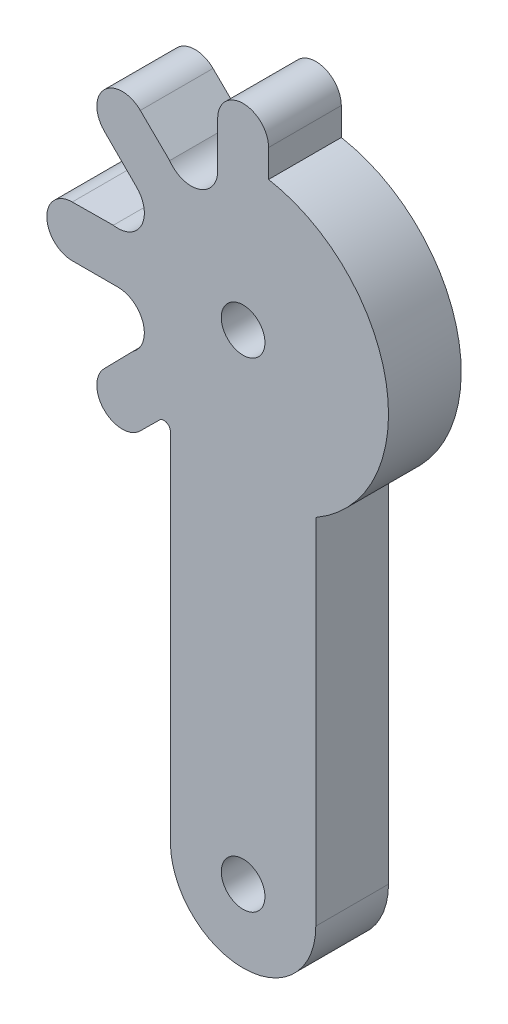
ISO-10303-21;
HEADER;
FILE_DESCRIPTION(('STEP AP214'),'2;1');
FILE_NAME('part.step','',(''),(''),'','','');
FILE_SCHEMA(('AUTOMOTIVE_DESIGN { 1 0 10303 214 1 1 1 1 }'));
ENDSEC;
DATA;
#1=APPLICATION_CONTEXT('core data for automotive mechanical design processes');
#2=APPLICATION_PROTOCOL_DEFINITION('international standard','automotive_design',2000,#1);
#3=PRODUCT_CONTEXT('',#1,'mechanical');
#4=PRODUCT('Part','Part','',(#3));
#5=PRODUCT_RELATED_PRODUCT_CATEGORY('part','',(#4));
#6=PRODUCT_DEFINITION_FORMATION('','',#4);
#7=PRODUCT_DEFINITION_CONTEXT('part definition',#1,'design');
#8=PRODUCT_DEFINITION('design','',#6,#7);
#9=PRODUCT_DEFINITION_SHAPE('','',#8);
#10=(LENGTH_UNIT() NAMED_UNIT(*) SI_UNIT(.MILLI.,.METRE.));
#11=(NAMED_UNIT(*) PLANE_ANGLE_UNIT() SI_UNIT($,.RADIAN.));
#12=(NAMED_UNIT(*) SI_UNIT($,.STERADIAN.) SOLID_ANGLE_UNIT());
#13=UNCERTAINTY_MEASURE_WITH_UNIT(LENGTH_MEASURE(1.E-05),#10,'distance_accuracy_value','');
#14=(GEOMETRIC_REPRESENTATION_CONTEXT(3) GLOBAL_UNCERTAINTY_ASSIGNED_CONTEXT((#13)) GLOBAL_UNIT_ASSIGNED_CONTEXT((#10,
#11,#12)) REPRESENTATION_CONTEXT('',''));
#15=CARTESIAN_POINT('',(0.,0.,0.));
#16=DIRECTION('',(0.,0.,1.));
#17=DIRECTION('',(1.,0.,0.));
#18=AXIS2_PLACEMENT_3D('',#15,#16,#17);
#19=CARTESIAN_POINT('',(-8.60435496311575,3.56722960093964,5.));
#20=DIRECTION('',(0.,0.,-1.));
#21=DIRECTION('',(-1.,0.,0.));
#22=AXIS2_PLACEMENT_3D('',#19,#20,#21);
#23=CYLINDRICAL_SURFACE('',#22,1.81450757459091);
#24=CARTESIAN_POINT('',(-8.60435496311575,3.56722960093964,0.));
#25=DIRECTION('',(0.,0.,1.));
#26=DIRECTION('',(1.,0.,0.));
#27=AXIS2_PLACEMENT_3D('',#24,#25,#26);
#28=CIRCLE('',#27,1.81450757459091);
#29=CARTESIAN_POINT('',(-8.9244970866409,1.78118739567333,0.));
#30=VERTEX_POINT('',#29);
#31=CARTESIAN_POINT('',(-7.32130435260817,4.85028021144723,0.));
#32=VERTEX_POINT('',#31);
#33=EDGE_CURVE('E224',#30,#32,#28,.T.);
#34=ORIENTED_EDGE('',*,*,#33,.F.);
#35=DIRECTION('',(0.,0.,-1.));
#36=VECTOR('',#35,1.);
#37=CARTESIAN_POINT('',(-8.9244970866409,1.78118739567333,5.));
#38=LINE('',#37,#36);
#39=CARTESIAN_POINT('',(-8.9244970866409,1.78118739567333,5.));
#40=VERTEX_POINT('',#39);
#41=EDGE_CURVE('E11',#40,#30,#38,.T.);
#42=ORIENTED_EDGE('',*,*,#41,.F.);
#43=CARTESIAN_POINT('',(-8.60435496311575,3.56722960093964,5.));
#44=DIRECTION('',(0.,0.,1.));
#45=DIRECTION('',(1.,0.,0.));
#46=AXIS2_PLACEMENT_3D('',#43,#44,#45);
#47=CIRCLE('',#46,1.81450757459091);
#48=CARTESIAN_POINT('',(-7.32130435260817,4.85028021144723,5.));
#49=VERTEX_POINT('',#48);
#50=EDGE_CURVE('E301',#40,#49,#47,.T.);
#51=ORIENTED_EDGE('',*,*,#50,.T.);
#52=DIRECTION('',(0.,0.,-1.));
#53=VECTOR('',#52,1.);
#54=CARTESIAN_POINT('',(-7.32130435260817,4.85028021144723,5.));
#55=LINE('',#54,#53);
#56=EDGE_CURVE('E129',#49,#32,#55,.T.);
#57=ORIENTED_EDGE('',*,*,#56,.T.);
#58=EDGE_LOOP('',(#34,#42,#51,#57));
#59=FACE_BOUND('',#58,.T.);
#60=ADVANCED_FACE('F42',(#59),#23,.F.);
#61=CARTESIAN_POINT('',(-0.0188511817434176,1.8709197069388,5.));
#62=DIRECTION('',(-0.0100753788774422,0.999949242082055,0.));
#63=DIRECTION('',(-0.999949242082055,-0.0100753788774422,0.));
#64=AXIS2_PLACEMENT_3D('',#61,#62,#63);
#65=PLANE('',#64);
#66=DIRECTION('',(0.999949242082055,0.0100753788774422,0.));
#67=VECTOR('',#66,1.);
#68=CARTESIAN_POINT('',(-0.0188511817434176,1.8709197069388,0.));
#69=LINE('',#68,#67);
#70=CARTESIAN_POINT('',(-11.7495942695045,1.7527220263475,0.));
#71=VERTEX_POINT('',#70);
#72=EDGE_CURVE('E228',#71,#30,#69,.T.);
#73=ORIENTED_EDGE('',*,*,#72,.F.);
#74=DIRECTION('',(0.,0.,-1.));
#75=VECTOR('',#74,1.);
#76=CARTESIAN_POINT('',(-11.7495942695045,1.7527220263475,5.));
#77=LINE('',#76,#75);
#78=CARTESIAN_POINT('',(-11.7495942695045,1.7527220263475,5.));
#79=VERTEX_POINT('',#78);
#80=EDGE_CURVE('E51',#79,#71,#77,.T.);
#81=ORIENTED_EDGE('',*,*,#80,.F.);
#82=DIRECTION('',(0.999949242082055,0.0100753788774422,0.));
#83=VECTOR('',#82,1.);
#84=CARTESIAN_POINT('',(-0.0188511817434176,1.8709197069388,5.));
#85=LINE('',#84,#83);
#86=EDGE_CURVE('E370',#79,#40,#85,.T.);
#87=ORIENTED_EDGE('',*,*,#86,.T.);
#88=ORIENTED_EDGE('',*,*,#41,.T.);
#89=EDGE_LOOP('',(#73,#81,#87,#88));
#90=FACE_BOUND('',#89,.T.);
#91=ADVANCED_FACE('F369',(#90),#65,.T.);
#92=CARTESIAN_POINT('',(-11.7497969770993,0.0027220498281179,5.));
#93=DIRECTION('',(0.,0.,-1.));
#94=DIRECTION('',(-1.,0.,0.));
#95=AXIS2_PLACEMENT_3D('',#92,#93,#94);
#96=CYLINDRICAL_SURFACE('',#95,1.74999998825949);
#97=CARTESIAN_POINT('',(-11.7497969770993,0.0027220498281179,0.));
#98=DIRECTION('',(0.,0.,1.));
#99=DIRECTION('',(1.,0.,0.));
#100=AXIS2_PLACEMENT_3D('',#97,#98,#99);
#101=CIRCLE('',#100,1.74999998825949);
#102=CARTESIAN_POINT('',(-11.7499996846942,-1.74727792669126,0.));
#103=VERTEX_POINT('',#102);
#104=EDGE_CURVE('E232',#71,#103,#101,.T.);
#105=ORIENTED_EDGE('',*,*,#104,.T.);
#106=DIRECTION('',(0.,0.,-1.));
#107=VECTOR('',#106,1.);
#108=CARTESIAN_POINT('',(-11.7499996846942,-1.74727792669126,5.));
#109=LINE('',#108,#107);
#110=CARTESIAN_POINT('',(-11.7499996846942,-1.74727792669126,5.));
#111=VERTEX_POINT('',#110);
#112=EDGE_CURVE('E350',#111,#103,#109,.T.);
#113=ORIENTED_EDGE('',*,*,#112,.F.);
#114=CARTESIAN_POINT('',(-11.7497969770993,0.0027220498281179,5.));
#115=DIRECTION('',(0.,0.,1.));
#116=DIRECTION('',(1.,0.,0.));
#117=AXIS2_PLACEMENT_3D('',#114,#115,#116);
#118=CIRCLE('',#117,1.74999998825949);
#119=EDGE_CURVE('E360',#79,#111,#118,.T.);
#120=ORIENTED_EDGE('',*,*,#119,.F.);
#121=ORIENTED_EDGE('',*,*,#80,.T.);
#122=EDGE_LOOP('',(#105,#113,#120,#121));
#123=FACE_BOUND('',#122,.T.);
#124=ADVANCED_FACE('F358',(#123),#96,.T.);
#125=CARTESIAN_POINT('',(0.,-1.74727792669126,5.));
#126=DIRECTION('',(0.,1.,0.));
#127=DIRECTION('',(0.,0.,1.));
#128=AXIS2_PLACEMENT_3D('',#125,#126,#127);
#129=PLANE('',#128);
#130=DIRECTION('',(1.,0.,0.));
#131=VECTOR('',#130,1.);
#132=CARTESIAN_POINT('',(0.,-1.74727792669126,0.));
#133=LINE('',#132,#131);
#134=CARTESIAN_POINT('',(-8.60660998302956,-1.74727792669126,0.));
#135=VERTEX_POINT('',#134);
#136=EDGE_CURVE('E234',#103,#135,#133,.T.);
#137=ORIENTED_EDGE('',*,*,#136,.T.);
#138=DIRECTION('',(0.,0.,-1.));
#139=VECTOR('',#138,1.);
#140=CARTESIAN_POINT('',(-8.60660998302956,-1.74727792669126,5.));
#141=LINE('',#140,#139);
#142=CARTESIAN_POINT('',(-8.60660998302956,-1.74727792669126,5.));
#143=VERTEX_POINT('',#142);
#144=EDGE_CURVE('E347',#143,#135,#141,.T.);
#145=ORIENTED_EDGE('',*,*,#144,.F.);
#146=DIRECTION('',(1.,0.,0.));
#147=VECTOR('',#146,1.);
#148=CARTESIAN_POINT('',(0.,-1.74727792669126,5.));
#149=LINE('',#148,#147);
#150=EDGE_CURVE('E381',#111,#143,#149,.T.);
#151=ORIENTED_EDGE('',*,*,#150,.F.);
#152=ORIENTED_EDGE('',*,*,#112,.T.);
#153=EDGE_LOOP('',(#137,#145,#151,#152));
#154=FACE_BOUND('',#153,.T.);
#155=ADVANCED_FACE('F479',(#154),#129,.F.);
#156=CARTESIAN_POINT('',(-8.60660998302956,-3.56178550128217,5.));
#157=DIRECTION('',(0.,0.,-1.));
#158=DIRECTION('',(-1.,0.,0.));
#159=AXIS2_PLACEMENT_3D('',#156,#157,#158);
#160=CYLINDRICAL_SURFACE('',#159,1.81450757459091);
#161=CARTESIAN_POINT('',(-8.60660998302956,-3.56178550128217,0.));
#162=DIRECTION('',(0.,0.,1.));
#163=DIRECTION('',(1.,0.,0.));
#164=AXIS2_PLACEMENT_3D('',#161,#162,#163);
#165=CIRCLE('',#164,1.81450757459091);
#166=CARTESIAN_POINT('',(-7.57006209468847,-5.05108272259946,0.));
#167=VERTEX_POINT('',#166);
#168=EDGE_CURVE('E238',#167,#135,#165,.T.);
#169=ORIENTED_EDGE('',*,*,#168,.F.);
#170=DIRECTION('',(0.,0.,-1.));
#171=VECTOR('',#170,1.);
#172=CARTESIAN_POINT('',(-7.57006209468847,-5.05108272259946,5.));
#173=LINE('',#172,#171);
#174=CARTESIAN_POINT('',(-7.57006209468847,-5.05108272259946,5.));
#175=VERTEX_POINT('',#174);
#176=EDGE_CURVE('E344',#175,#167,#173,.T.);
#177=ORIENTED_EDGE('',*,*,#176,.F.);
#178=CARTESIAN_POINT('',(-8.60660998302956,-3.56178550128217,5.));
#179=DIRECTION('',(0.,0.,1.));
#180=DIRECTION('',(1.,0.,0.));
#181=AXIS2_PLACEMENT_3D('',#178,#179,#180);
#182=CIRCLE('',#181,1.81450757459091);
#183=EDGE_CURVE('E384',#175,#143,#182,.T.);
#184=ORIENTED_EDGE('',*,*,#183,.T.);
#185=ORIENTED_EDGE('',*,*,#144,.T.);
#186=EDGE_LOOP('',(#169,#177,#184,#185));
#187=FACE_BOUND('',#186,.T.);
#188=ADVANCED_FACE('F475',(#187),#160,.F.);
#189=CARTESIAN_POINT('',(-1.33626981027573,1.30961021338754,5.));
#190=DIRECTION('',(-0.714195258645806,0.699946521191333,0.));
#191=DIRECTION('',(-0.699946521191333,-0.714195258645806,0.));
#192=AXIS2_PLACEMENT_3D('',#189,#190,#191);
#193=PLANE('',#192);
#194=DIRECTION('',(0.699946521191333,0.714195258645806,0.));
#195=VECTOR('',#194,1.);
#196=CARTESIAN_POINT('',(-1.33626981027573,1.30961021338754,0.));
#197=LINE('',#196,#195);
#198=CARTESIAN_POINT('',(-9.54757941452242,-7.06885615379178,0.));
#199=VERTEX_POINT('',#198);
#200=EDGE_CURVE('E242',#199,#167,#197,.T.);
#201=ORIENTED_EDGE('',*,*,#200,.F.);
#202=DIRECTION('',(0.,0.,-1.));
#203=VECTOR('',#202,1.);
#204=CARTESIAN_POINT('',(-9.54757941452242,-7.06885615379178,5.));
#205=LINE('',#204,#203);
#206=CARTESIAN_POINT('',(-9.54757941452242,-7.06885615379178,5.));
#207=VERTEX_POINT('',#206);
#208=EDGE_CURVE('E341',#207,#199,#205,.T.);
#209=ORIENTED_EDGE('',*,*,#208,.F.);
#210=DIRECTION('',(0.699946521191333,0.714195258645806,0.));
#211=VECTOR('',#210,1.);
#212=CARTESIAN_POINT('',(-1.33626981027573,1.30961021338754,5.));
#213=LINE('',#212,#211);
#214=EDGE_CURVE('E388',#207,#175,#213,.T.);
#215=ORIENTED_EDGE('',*,*,#214,.T.);
#216=ORIENTED_EDGE('',*,*,#176,.T.);
#217=EDGE_LOOP('',(#201,#209,#215,#216));
#218=FACE_BOUND('',#217,.T.);
#219=ADVANCED_FACE('F469',(#218),#193,.T.);
#220=CARTESIAN_POINT('',(-8.3104292524822,-8.30657965949242,5.));
#221=DIRECTION('',(0.,0.,-1.));
#222=DIRECTION('',(-1.,0.,0.));
#223=AXIS2_PLACEMENT_3D('',#220,#221,#222);
#224=CYLINDRICAL_SURFACE('',#223,1.75);
#225=CARTESIAN_POINT('',(-8.3104292524822,-8.30657965949242,0.));
#226=DIRECTION('',(0.,0.,1.));
#227=DIRECTION('',(1.,0.,0.));
#228=AXIS2_PLACEMENT_3D('',#225,#226,#227);
#229=CIRCLE('',#228,1.75);
#230=CARTESIAN_POINT('',(-7.07299238540574,-9.54401652656888,0.));
#231=VERTEX_POINT('',#230);
#232=EDGE_CURVE('E246',#199,#231,#229,.T.);
#233=ORIENTED_EDGE('',*,*,#232,.T.);
#234=DIRECTION('',(0.,0.,-1.));
#235=VECTOR('',#234,1.);
#236=CARTESIAN_POINT('',(-7.07299238540574,-9.54401652656888,5.));
#237=LINE('',#236,#235);
#238=CARTESIAN_POINT('',(-7.07299238540574,-9.54401652656888,5.));
#239=VERTEX_POINT('',#238);
#240=EDGE_CURVE('E337',#239,#231,#237,.T.);
#241=ORIENTED_EDGE('',*,*,#240,.F.);
#242=CARTESIAN_POINT('',(-8.3104292524822,-8.30657965949242,5.));
#243=DIRECTION('',(0.,0.,1.));
#244=DIRECTION('',(1.,0.,0.));
#245=AXIS2_PLACEMENT_3D('',#242,#243,#244);
#246=CIRCLE('',#245,1.75);
#247=EDGE_CURVE('E392',#207,#239,#246,.T.);
#248=ORIENTED_EDGE('',*,*,#247,.F.);
#249=ORIENTED_EDGE('',*,*,#208,.T.);
#250=EDGE_LOOP('',(#233,#241,#248,#249));
#251=FACE_BOUND('',#250,.T.);
#252=ADVANCED_FACE('F480',(#251),#224,.T.);
#253=CARTESIAN_POINT('',(1.25999875279265,-1.26879482078728,5.));
#254=DIRECTION('',(-0.704642942712236,0.70956206443541,0.));
#255=DIRECTION('',(-0.70956206443541,-0.704642942712236,0.));
#256=AXIS2_PLACEMENT_3D('',#253,#254,#255);
#257=PLANE('',#256);
#258=DIRECTION('',(0.70956206443541,0.704642942712236,0.));
#259=VECTOR('',#258,1.);
#260=CARTESIAN_POINT('',(1.25999875279265,-1.26879482078728,0.));
#261=LINE('',#260,#259);
#262=CARTESIAN_POINT('',(-5.75027059710416,-8.23046466125033,0.));
#263=VERTEX_POINT('',#262);
#264=EDGE_CURVE('E249',#231,#263,#261,.T.);
#265=ORIENTED_EDGE('',*,*,#264,.T.);
#266=DIRECTION('',(0.,0.,-1.));
#267=VECTOR('',#266,1.);
#268=CARTESIAN_POINT('',(-5.75027059710416,-8.23046466125033,5.));
#269=LINE('',#268,#267);
#270=CARTESIAN_POINT('',(-5.75027059710416,-8.23046466125033,5.));
#271=VERTEX_POINT('',#270);
#272=EDGE_CURVE('E334',#271,#263,#269,.T.);
#273=ORIENTED_EDGE('',*,*,#272,.F.);
#274=DIRECTION('',(0.70956206443541,0.704642942712236,0.));
#275=VECTOR('',#274,1.);
#276=CARTESIAN_POINT('',(1.25999875279265,-1.26879482078728,5.));
#277=LINE('',#276,#275);
#278=EDGE_CURVE('E395',#239,#271,#277,.T.);
#279=ORIENTED_EDGE('',*,*,#278,.F.);
#280=ORIENTED_EDGE('',*,*,#240,.T.);
#281=EDGE_LOOP('',(#265,#273,#279,#280));
#282=FACE_BOUND('',#281,.T.);
#283=ADVANCED_FACE('F463',(#282),#257,.F.);
#284=CARTESIAN_POINT('',(-5.44013357771594,-8.54276675128179,5.));
#285=DIRECTION('',(0.,0.,-1.));
#286=DIRECTION('',(-1.,0.,0.));
#287=AXIS2_PLACEMENT_3D('',#284,#285,#286);
#288=CYLINDRICAL_SURFACE('',#287,0.440133577715941);
#289=CARTESIAN_POINT('',(-5.44013357771594,-8.54276675128179,0.));
#290=DIRECTION('',(0.,0.,1.));
#291=DIRECTION('',(1.,0.,0.));
#292=AXIS2_PLACEMENT_3D('',#289,#290,#291);
#293=CIRCLE('',#292,0.440133577715941);
#294=CARTESIAN_POINT('',(-5.,-8.54276675128179,0.));
#295=VERTEX_POINT('',#294);
#296=EDGE_CURVE('E253',#295,#263,#293,.T.);
#297=ORIENTED_EDGE('',*,*,#296,.F.);
#298=DIRECTION('',(0.,0.,-1.));
#299=VECTOR('',#298,1.);
#300=CARTESIAN_POINT('',(-5.,-8.54276675128179,5.));
#301=LINE('',#300,#299);
#302=CARTESIAN_POINT('',(-5.,-8.54276675128179,5.));
#303=VERTEX_POINT('',#302);
#304=EDGE_CURVE('E331',#303,#295,#301,.T.);
#305=ORIENTED_EDGE('',*,*,#304,.F.);
#306=CARTESIAN_POINT('',(-5.44013357771594,-8.54276675128179,5.));
#307=DIRECTION('',(0.,0.,1.));
#308=DIRECTION('',(1.,0.,0.));
#309=AXIS2_PLACEMENT_3D('',#306,#307,#308);
#310=CIRCLE('',#309,0.440133577715941);
#311=EDGE_CURVE('E398',#303,#271,#310,.T.);
#312=ORIENTED_EDGE('',*,*,#311,.T.);
#313=ORIENTED_EDGE('',*,*,#272,.T.);
#314=EDGE_LOOP('',(#297,#305,#312,#313));
#315=FACE_BOUND('',#314,.T.);
#316=ADVANCED_FACE('F457',(#315),#288,.F.);
#317=CARTESIAN_POINT('',(-4.99999999999998,0.,5.));
#318=DIRECTION('',(1.,0.,0.));
#319=DIRECTION('',(0.,1.,0.));
#320=AXIS2_PLACEMENT_3D('',#317,#318,#319);
#321=PLANE('',#320);
#322=DIRECTION('',(0.,-1.,0.));
#323=VECTOR('',#322,1.);
#324=CARTESIAN_POINT('',(-4.99999999999998,0.,0.));
#325=LINE('',#324,#323);
#326=CARTESIAN_POINT('',(-5.00000000000005,-33.,0.));
#327=VERTEX_POINT('',#326);
#328=EDGE_CURVE('E257',#295,#327,#325,.T.);
#329=ORIENTED_EDGE('',*,*,#328,.T.);
#330=DIRECTION('',(0.,0.,-1.));
#331=VECTOR('',#330,1.);
#332=CARTESIAN_POINT('',(-5.00000000000005,-33.,5.));
#333=LINE('',#332,#331);
#334=CARTESIAN_POINT('',(-5.00000000000005,-33.,5.));
#335=VERTEX_POINT('',#334);
#336=EDGE_CURVE('E327',#335,#327,#333,.T.);
#337=ORIENTED_EDGE('',*,*,#336,.F.);
#338=DIRECTION('',(0.,-1.,0.));
#339=VECTOR('',#338,1.);
#340=CARTESIAN_POINT('',(-4.99999999999998,0.,5.));
#341=LINE('',#340,#339);
#342=EDGE_CURVE('E402',#303,#335,#341,.T.);
#343=ORIENTED_EDGE('',*,*,#342,.F.);
#344=ORIENTED_EDGE('',*,*,#304,.T.);
#345=EDGE_LOOP('',(#329,#337,#343,#344));
#346=FACE_BOUND('',#345,.T.);
#347=ADVANCED_FACE('F523',(#346),#321,.F.);
#348=CARTESIAN_POINT('',(0.,-33.,5.));
#349=DIRECTION('',(0.,0.,-1.));
#350=DIRECTION('',(-1.,0.,0.));
#351=AXIS2_PLACEMENT_3D('',#348,#349,#350);
#352=CYLINDRICAL_SURFACE('',#351,5.00000000000002);
#353=CARTESIAN_POINT('',(0.,-33.,0.));
#354=DIRECTION('',(0.,0.,1.));
#355=DIRECTION('',(1.,0.,0.));
#356=AXIS2_PLACEMENT_3D('',#353,#354,#355);
#357=CIRCLE('',#356,5.00000000000002);
#358=CARTESIAN_POINT('',(5.,-33.,0.));
#359=VERTEX_POINT('',#358);
#360=EDGE_CURVE('E260',#327,#359,#357,.T.);
#361=ORIENTED_EDGE('',*,*,#360,.T.);
#362=DIRECTION('',(0.,0.,-1.));
#363=VECTOR('',#362,1.);
#364=CARTESIAN_POINT('',(5.,-33.,5.));
#365=LINE('',#364,#363);
#366=CARTESIAN_POINT('',(5.,-33.,5.));
#367=VERTEX_POINT('',#366);
#368=EDGE_CURVE('E324',#367,#359,#365,.T.);
#369=ORIENTED_EDGE('',*,*,#368,.F.);
#370=CARTESIAN_POINT('',(0.,-33.,5.));
#371=DIRECTION('',(0.,0.,1.));
#372=DIRECTION('',(1.,0.,0.));
#373=AXIS2_PLACEMENT_3D('',#370,#371,#372);
#374=CIRCLE('',#373,5.00000000000002);
#375=EDGE_CURVE('E405',#335,#367,#374,.T.);
#376=ORIENTED_EDGE('',*,*,#375,.F.);
#377=ORIENTED_EDGE('',*,*,#336,.T.);
#378=EDGE_LOOP('',(#361,#369,#376,#377));
#379=FACE_BOUND('',#378,.T.);
#380=ADVANCED_FACE('F450',(#379),#352,.T.);
#381=CARTESIAN_POINT('',(5.,0.,5.));
#382=DIRECTION('',(1.,0.,0.));
#383=DIRECTION('',(0.,1.,0.));
#384=AXIS2_PLACEMENT_3D('',#381,#382,#383);
#385=PLANE('',#384);
#386=DIRECTION('',(0.,-1.,0.));
#387=VECTOR('',#386,1.);
#388=CARTESIAN_POINT('',(5.,0.,0.));
#389=LINE('',#388,#387);
#390=CARTESIAN_POINT('',(5.,-8.66025403784439,0.));
#391=VERTEX_POINT('',#390);
#392=EDGE_CURVE('E264',#391,#359,#389,.T.);
#393=ORIENTED_EDGE('',*,*,#392,.F.);
#394=DIRECTION('',(0.,0.,-1.));
#395=VECTOR('',#394,1.);
#396=CARTESIAN_POINT('',(5.,-8.66025403784439,5.));
#397=LINE('',#396,#395);
#398=CARTESIAN_POINT('',(5.,-8.66025403784439,5.));
#399=VERTEX_POINT('',#398);
#400=EDGE_CURVE('E321',#399,#391,#397,.T.);
#401=ORIENTED_EDGE('',*,*,#400,.F.);
#402=DIRECTION('',(0.,-1.,0.));
#403=VECTOR('',#402,1.);
#404=CARTESIAN_POINT('',(5.,0.,5.));
#405=LINE('',#404,#403);
#406=EDGE_CURVE('E407',#399,#367,#405,.T.);
#407=ORIENTED_EDGE('',*,*,#406,.T.);
#408=ORIENTED_EDGE('',*,*,#368,.T.);
#409=EDGE_LOOP('',(#393,#401,#407,#408));
#410=FACE_BOUND('',#409,.T.);
#411=ADVANCED_FACE('F445',(#410),#385,.T.);
#412=CARTESIAN_POINT('',(0.,0.,5.));
#413=DIRECTION('',(0.,0.,-1.));
#414=DIRECTION('',(-1.,0.,0.));
#415=AXIS2_PLACEMENT_3D('',#412,#413,#414);
#416=CYLINDRICAL_SURFACE('',#415,10.);
#417=CARTESIAN_POINT('',(0.,0.,0.));
#418=DIRECTION('',(0.,0.,1.));
#419=DIRECTION('',(1.,0.,0.));
#420=AXIS2_PLACEMENT_3D('',#417,#418,#419);
#421=CIRCLE('',#420,10.);
#422=CARTESIAN_POINT('',(1.75272202634986,9.84520012485008,0.));
#423=VERTEX_POINT('',#422);
#424=EDGE_CURVE('E268',#391,#423,#421,.T.);
#425=ORIENTED_EDGE('',*,*,#424,.T.);
#426=DIRECTION('',(0.,0.,-1.));
#427=VECTOR('',#426,1.);
#428=CARTESIAN_POINT('',(1.75272202634986,9.84520012485008,5.));
#429=LINE('',#428,#427);
#430=CARTESIAN_POINT('',(1.75272202634986,9.84520012485008,5.));
#431=VERTEX_POINT('',#430);
#432=EDGE_CURVE('E318',#431,#423,#429,.T.);
#433=ORIENTED_EDGE('',*,*,#432,.F.);
#434=CARTESIAN_POINT('',(0.,0.,5.));
#435=DIRECTION('',(0.,0.,1.));
#436=DIRECTION('',(1.,0.,0.));
#437=AXIS2_PLACEMENT_3D('',#434,#435,#436);
#438=CIRCLE('',#437,10.);
#439=EDGE_CURVE('E411',#399,#431,#438,.T.);
#440=ORIENTED_EDGE('',*,*,#439,.F.);
#441=ORIENTED_EDGE('',*,*,#400,.T.);
#442=EDGE_LOOP('',(#425,#433,#440,#441));
#443=FACE_BOUND('',#442,.T.);
#444=ADVANCED_FACE('F441',(#443),#416,.T.);
#445=CARTESIAN_POINT('',(1.75272202634986,0.,5.));
#446=DIRECTION('',(1.,0.,0.));
#447=DIRECTION('',(0.,0.,-1.));
#448=AXIS2_PLACEMENT_3D('',#445,#446,#447);
#449=PLANE('',#448);
#450=DIRECTION('',(0.,-1.,0.));
#451=VECTOR('',#450,1.);
#452=CARTESIAN_POINT('',(1.75272202634986,0.,0.));
#453=LINE('',#452,#451);
#454=CARTESIAN_POINT('',(1.75272202634986,11.7495942695041,0.));
#455=VERTEX_POINT('',#454);
#456=EDGE_CURVE('E272',#455,#423,#453,.T.);
#457=ORIENTED_EDGE('',*,*,#456,.F.);
#458=DIRECTION('',(0.,0.,-1.));
#459=VECTOR('',#458,1.);
#460=CARTESIAN_POINT('',(1.75272202634986,11.7495942695041,5.));
#461=LINE('',#460,#459);
#462=CARTESIAN_POINT('',(1.75272202634986,11.7495942695041,5.));
#463=VERTEX_POINT('',#462);
#464=EDGE_CURVE('E315',#463,#455,#461,.T.);
#465=ORIENTED_EDGE('',*,*,#464,.F.);
#466=DIRECTION('',(0.,-1.,0.));
#467=VECTOR('',#466,1.);
#468=CARTESIAN_POINT('',(1.75272202634986,0.,5.));
#469=LINE('',#468,#467);
#470=EDGE_CURVE('E414',#463,#431,#469,.T.);
#471=ORIENTED_EDGE('',*,*,#470,.T.);
#472=ORIENTED_EDGE('',*,*,#432,.T.);
#473=EDGE_LOOP('',(#457,#465,#471,#472));
#474=FACE_BOUND('',#473,.T.);
#475=ADVANCED_FACE('F437',(#474),#449,.T.);
#476=CARTESIAN_POINT('',(0.00272207331027802,11.7499996846943,5.));
#477=DIRECTION('',(0.,0.,-1.));
#478=DIRECTION('',(-1.,0.,0.));
#479=AXIS2_PLACEMENT_3D('',#476,#477,#478);
#480=CYLINDRICAL_SURFACE('',#479,1.75);
#481=CARTESIAN_POINT('',(0.00272207331027802,11.7499996846943,0.));
#482=DIRECTION('',(0.,0.,1.));
#483=DIRECTION('',(1.,0.,0.));
#484=AXIS2_PLACEMENT_3D('',#481,#482,#483);
#485=CIRCLE('',#484,1.75);
#486=CARTESIAN_POINT('',(-1.74727792668972,11.7499996846943,0.));
#487=VERTEX_POINT('',#486);
#488=EDGE_CURVE('E276',#455,#487,#485,.T.);
#489=ORIENTED_EDGE('',*,*,#488,.T.);
#490=DIRECTION('',(0.,0.,-1.));
#491=VECTOR('',#490,1.);
#492=CARTESIAN_POINT('',(-1.74727792668972,11.7499996846943,5.));
#493=LINE('',#492,#491);
#494=CARTESIAN_POINT('',(-1.74727792668972,11.7499996846943,5.));
#495=VERTEX_POINT('',#494);
#496=EDGE_CURVE('E311',#495,#487,#493,.T.);
#497=ORIENTED_EDGE('',*,*,#496,.F.);
#498=CARTESIAN_POINT('',(0.00272207331027802,11.7499996846943,5.));
#499=DIRECTION('',(0.,0.,1.));
#500=DIRECTION('',(1.,0.,0.));
#501=AXIS2_PLACEMENT_3D('',#498,#499,#500);
#502=CIRCLE('',#501,1.75);
#503=EDGE_CURVE('E418',#463,#495,#502,.T.);
#504=ORIENTED_EDGE('',*,*,#503,.F.);
#505=ORIENTED_EDGE('',*,*,#464,.T.);
#506=EDGE_LOOP('',(#489,#497,#504,#505));
#507=FACE_BOUND('',#506,.T.);
#508=ADVANCED_FACE('F559',(#507),#480,.T.);
#509=CARTESIAN_POINT('',(-1.74727792668972,0.,5.));
#510=DIRECTION('',(1.,0.,0.));
#511=DIRECTION('',(0.,0.,-1.));
#512=AXIS2_PLACEMENT_3D('',#509,#510,#511);
#513=PLANE('',#512);
#514=DIRECTION('',(0.,-1.,0.));
#515=VECTOR('',#514,1.);
#516=CARTESIAN_POINT('',(-1.74727792668972,0.,0.));
#517=LINE('',#516,#515);
#518=CARTESIAN_POINT('',(-1.74727792668972,8.60660998302923,0.));
#519=VERTEX_POINT('',#518);
#520=EDGE_CURVE('E279',#487,#519,#517,.T.);
#521=ORIENTED_EDGE('',*,*,#520,.T.);
#522=DIRECTION('',(0.,0.,-1.));
#523=VECTOR('',#522,1.);
#524=CARTESIAN_POINT('',(-1.74727792668972,8.60660998302923,5.));
#525=LINE('',#524,#523);
#526=CARTESIAN_POINT('',(-1.74727792668972,8.60660998302923,5.));
#527=VERTEX_POINT('',#526);
#528=EDGE_CURVE('E308',#527,#519,#525,.T.);
#529=ORIENTED_EDGE('',*,*,#528,.F.);
#530=DIRECTION('',(0.,-1.,0.));
#531=VECTOR('',#530,1.);
#532=CARTESIAN_POINT('',(-1.74727792668972,0.,5.));
#533=LINE('',#532,#531);
#534=EDGE_CURVE('E210',#495,#527,#533,.T.);
#535=ORIENTED_EDGE('',*,*,#534,.F.);
#536=ORIENTED_EDGE('',*,*,#496,.T.);
#537=EDGE_LOOP('',(#521,#529,#535,#536));
#538=FACE_BOUND('',#537,.T.);
#539=ADVANCED_FACE('F427',(#538),#513,.F.);
#540=CARTESIAN_POINT('',(-3.56178550128063,8.60660998302923,5.));
#541=DIRECTION('',(0.,0.,-1.));
#542=DIRECTION('',(-1.,0.,0.));
#543=AXIS2_PLACEMENT_3D('',#540,#541,#542);
#544=CYLINDRICAL_SURFACE('',#543,1.81450757459091);
#545=CARTESIAN_POINT('',(-3.56178550128063,8.60660998302923,0.));
#546=DIRECTION('',(0.,0.,1.));
#547=DIRECTION('',(1.,0.,0.));
#548=AXIS2_PLACEMENT_3D('',#545,#546,#547);
#549=CIRCLE('',#548,1.81450757459091);
#550=CARTESIAN_POINT('',(-5.05108272259791,7.57006209468814,0.));
#551=VERTEX_POINT('',#550);
#552=EDGE_CURVE('E282',#551,#519,#549,.T.);
#553=ORIENTED_EDGE('',*,*,#552,.F.);
#554=DIRECTION('',(0.,0.,-1.));
#555=VECTOR('',#554,1.);
#556=CARTESIAN_POINT('',(-5.05108272259791,7.57006209468814,5.));
#557=LINE('',#556,#555);
#558=CARTESIAN_POINT('',(-5.05108272259791,7.57006209468814,5.));
#559=VERTEX_POINT('',#558);
#560=EDGE_CURVE('E193',#559,#551,#557,.T.);
#561=ORIENTED_EDGE('',*,*,#560,.F.);
#562=CARTESIAN_POINT('',(-3.56178550128063,8.60660998302923,5.));
#563=DIRECTION('',(0.,0.,1.));
#564=DIRECTION('',(1.,0.,0.));
#565=AXIS2_PLACEMENT_3D('',#562,#563,#564);
#566=CIRCLE('',#565,1.81450757459091);
#567=EDGE_CURVE('E204',#559,#527,#566,.T.);
#568=ORIENTED_EDGE('',*,*,#567,.T.);
#569=ORIENTED_EDGE('',*,*,#528,.T.);
#570=EDGE_LOOP('',(#553,#561,#568,#569));
#571=FACE_BOUND('',#570,.T.);
#572=ADVANCED_FACE('F431',(#571),#544,.F.);
#573=CARTESIAN_POINT('',(1.30961021338617,1.33626981027328,5.));
#574=DIRECTION('',(0.699946521191618,0.714195258645527,0.));
#575=DIRECTION('',(-0.714195258645527,0.699946521191618,0.));
#576=AXIS2_PLACEMENT_3D('',#573,#574,#575);
#577=PLANE('',#576);
#578=DIRECTION('',(0.714195258645527,-0.699946521191618,0.));
#579=VECTOR('',#578,1.);
#580=CARTESIAN_POINT('',(1.30961021338617,1.33626981027328,0.));
#581=LINE('',#580,#579);
#582=CARTESIAN_POINT('',(-7.06885615378977,9.54757941452321,0.));
#583=VERTEX_POINT('',#582);
#584=EDGE_CURVE('E191',#583,#551,#581,.T.);
#585=ORIENTED_EDGE('',*,*,#584,.F.);
#586=DIRECTION('',(0.,0.,-1.));
#587=VECTOR('',#586,1.);
#588=CARTESIAN_POINT('',(-7.06885615378977,9.54757941452321,5.));
#589=LINE('',#588,#587);
#590=CARTESIAN_POINT('',(-7.06885615378977,9.54757941452321,5.));
#591=VERTEX_POINT('',#590);
#592=EDGE_CURVE('E185',#591,#583,#589,.T.);
#593=ORIENTED_EDGE('',*,*,#592,.F.);
#594=DIRECTION('',(0.714195258645527,-0.699946521191618,0.));
#595=VECTOR('',#594,1.);
#596=CARTESIAN_POINT('',(1.30961021338617,1.33626981027328,5.));
#597=LINE('',#596,#595);
#598=EDGE_CURVE('E189',#591,#559,#597,.T.);
#599=ORIENTED_EDGE('',*,*,#598,.T.);
#600=ORIENTED_EDGE('',*,*,#560,.T.);
#601=EDGE_LOOP('',(#585,#593,#599,#600));
#602=FACE_BOUND('',#601,.T.);
#603=ADVANCED_FACE('F187',(#602),#577,.T.);
#604=CARTESIAN_POINT('',(-8.30643634017848,8.31028589996473,5.));
#605=DIRECTION('',(0.,0.,-1.));
#606=DIRECTION('',(-1.,0.,0.));
#607=AXIS2_PLACEMENT_3D('',#604,#605,#606);
#608=CYLINDRICAL_SURFACE('',#607,1.7499999882599);
#609=CARTESIAN_POINT('',(-8.30643634017848,8.31028589996473,0.));
#610=DIRECTION('',(0.,0.,1.));
#611=DIRECTION('',(1.,0.,0.));
#612=AXIS2_PLACEMENT_3D('',#609,#610,#611);
#613=CIRCLE('',#612,1.7499999882599);
#614=CARTESIAN_POINT('',(-9.54401652656687,7.07299238540654,0.));
#615=VERTEX_POINT('',#614);
#616=EDGE_CURVE('E122',#583,#615,#613,.T.);
#617=ORIENTED_EDGE('',*,*,#616,.T.);
#618=DIRECTION('',(0.,0.,-1.));
#619=VECTOR('',#618,1.);
#620=CARTESIAN_POINT('',(-9.54401652656687,7.07299238540654,5.));
#621=LINE('',#620,#619);
#622=CARTESIAN_POINT('',(-9.54401652656687,7.07299238540654,5.));
#623=VERTEX_POINT('',#622);
#624=EDGE_CURVE('E194',#623,#615,#621,.T.);
#625=ORIENTED_EDGE('',*,*,#624,.F.);
#626=CARTESIAN_POINT('',(-8.30643634017848,8.31028589996473,5.));
#627=DIRECTION('',(0.,0.,1.));
#628=DIRECTION('',(1.,0.,0.));
#629=AXIS2_PLACEMENT_3D('',#626,#627,#628);
#630=CIRCLE('',#629,1.7499999882599);
#631=EDGE_CURVE('E196',#591,#623,#630,.T.);
#632=ORIENTED_EDGE('',*,*,#631,.F.);
#633=ORIENTED_EDGE('',*,*,#592,.T.);
#634=EDGE_LOOP('',(#617,#625,#632,#633));
#635=FACE_BOUND('',#634,.T.);
#636=ADVANCED_FACE('F197',(#635),#608,.T.);
#637=CARTESIAN_POINT('',(0.,0.,5.));
#638=DIRECTION('',(0.,0.,-1.));
#639=DIRECTION('',(-1.,0.,0.));
#640=AXIS2_PLACEMENT_3D('',#637,#638,#639);
#641=CYLINDRICAL_SURFACE('',#640,1.5);
#642=CARTESIAN_POINT('',(0.,0.,5.));
#643=DIRECTION('',(0.,0.,1.));
#644=DIRECTION('',(1.,0.,0.));
#645=AXIS2_PLACEMENT_3D('',#642,#643,#644);
#646=CIRCLE('',#645,1.5);
#647=CARTESIAN_POINT('',(1.5,0.,5.));
#648=VERTEX_POINT('',#647);
#649=EDGE_CURVE('E216',#648,#648,#646,.T.);
#650=ORIENTED_EDGE('',*,*,#649,.T.);
#651=EDGE_LOOP('',(#650));
#652=FACE_BOUND('',#651,.T.);
#653=CARTESIAN_POINT('',(0.,0.,0.));
#654=DIRECTION('',(0.,0.,1.));
#655=DIRECTION('',(1.,0.,0.));
#656=AXIS2_PLACEMENT_3D('',#653,#654,#655);
#657=CIRCLE('',#656,1.5);
#658=CARTESIAN_POINT('',(1.5,0.,0.));
#659=VERTEX_POINT('',#658);
#660=EDGE_CURVE('E293',#659,#659,#657,.T.);
#661=ORIENTED_EDGE('',*,*,#660,.F.);
#662=EDGE_LOOP('',(#661));
#663=FACE_BOUND('',#662,.T.);
#664=ADVANCED_FACE('F595',(#652,#663),#641,.F.);
#665=CARTESIAN_POINT('',(-1.23551207058147,-1.23551207058113,5.));
#666=DIRECTION('',(0.707106781186644,0.707106781186451,0.));
#667=DIRECTION('',(-0.707106781186451,0.707106781186644,0.));
#668=AXIS2_PLACEMENT_3D('',#665,#666,#667);
#669=PLANE('',#668);
#670=DIRECTION('',(0.707106781186451,-0.707106781186644,0.));
#671=VECTOR('',#670,1.);
#672=CARTESIAN_POINT('',(-1.23551207058147,-1.23551207058113,0.));
#673=LINE('',#672,#671);
#674=EDGE_CURVE('E290',#615,#32,#673,.T.);
#675=ORIENTED_EDGE('',*,*,#674,.T.);
#676=ORIENTED_EDGE('',*,*,#56,.F.);
#677=DIRECTION('',(0.707106781186451,-0.707106781186644,0.));
#678=VECTOR('',#677,1.);
#679=CARTESIAN_POINT('',(-1.23551207058147,-1.23551207058113,5.));
#680=LINE('',#679,#678);
#681=EDGE_CURVE('E59',#623,#49,#680,.T.);
#682=ORIENTED_EDGE('',*,*,#681,.F.);
#683=ORIENTED_EDGE('',*,*,#624,.T.);
#684=EDGE_LOOP('',(#675,#676,#682,#683));
#685=FACE_BOUND('',#684,.T.);
#686=ADVANCED_FACE('F373',(#685),#669,.F.);
#687=CARTESIAN_POINT('',(0.,-33.,5.));
#688=DIRECTION('',(0.,0.,-1.));
#689=DIRECTION('',(-1.,0.,0.));
#690=AXIS2_PLACEMENT_3D('',#687,#688,#689);
#691=CYLINDRICAL_SURFACE('',#690,1.5);
#692=CARTESIAN_POINT('',(0.,-33.,5.));
#693=DIRECTION('',(0.,0.,1.));
#694=DIRECTION('',(1.,0.,0.));
#695=AXIS2_PLACEMENT_3D('',#692,#693,#694);
#696=CIRCLE('',#695,1.5);
#697=CARTESIAN_POINT('',(1.5,-33.,5.));
#698=VERTEX_POINT('',#697);
#699=EDGE_CURVE('E220',#698,#698,#696,.T.);
#700=ORIENTED_EDGE('',*,*,#699,.T.);
#701=EDGE_LOOP('',(#700));
#702=FACE_BOUND('',#701,.T.);
#703=CARTESIAN_POINT('',(0.,-33.,0.));
#704=DIRECTION('',(0.,0.,1.));
#705=DIRECTION('',(1.,0.,0.));
#706=AXIS2_PLACEMENT_3D('',#703,#704,#705);
#707=CIRCLE('',#706,1.5);
#708=CARTESIAN_POINT('',(1.5,-33.,0.));
#709=VERTEX_POINT('',#708);
#710=EDGE_CURVE('E297',#709,#709,#707,.T.);
#711=ORIENTED_EDGE('',*,*,#710,.F.);
#712=EDGE_LOOP('',(#711));
#713=FACE_BOUND('',#712,.T.);
#714=ADVANCED_FACE('F611',(#702,#713),#691,.F.);
#715=CARTESIAN_POINT('',(0.,0.,5.));
#716=DIRECTION('',(0.,0.,1.));
#717=DIRECTION('',(1.,0.,0.));
#718=AXIS2_PLACEMENT_3D('',#715,#716,#717);
#719=PLANE('',#718);
#720=ORIENTED_EDGE('',*,*,#50,.F.);
#721=ORIENTED_EDGE('',*,*,#86,.F.);
#722=ORIENTED_EDGE('',*,*,#119,.T.);
#723=ORIENTED_EDGE('',*,*,#150,.T.);
#724=ORIENTED_EDGE('',*,*,#183,.F.);
#725=ORIENTED_EDGE('',*,*,#214,.F.);
#726=ORIENTED_EDGE('',*,*,#247,.T.);
#727=ORIENTED_EDGE('',*,*,#278,.T.);
#728=ORIENTED_EDGE('',*,*,#311,.F.);
#729=ORIENTED_EDGE('',*,*,#342,.T.);
#730=ORIENTED_EDGE('',*,*,#375,.T.);
#731=ORIENTED_EDGE('',*,*,#406,.F.);
#732=ORIENTED_EDGE('',*,*,#439,.T.);
#733=ORIENTED_EDGE('',*,*,#470,.F.);
#734=ORIENTED_EDGE('',*,*,#503,.T.);
#735=ORIENTED_EDGE('',*,*,#534,.T.);
#736=ORIENTED_EDGE('',*,*,#567,.F.);
#737=ORIENTED_EDGE('',*,*,#598,.F.);
#738=ORIENTED_EDGE('',*,*,#631,.T.);
#739=ORIENTED_EDGE('',*,*,#681,.T.);
#740=EDGE_LOOP('',(#720,#721,#722,#723,#724,#725,#726,#727,#728,#729,#730,#731,#732,#733,#734,
#735,#736,#737,#738,#739));
#741=FACE_BOUND('',#740,.T.);
#742=ORIENTED_EDGE('',*,*,#649,.F.);
#743=EDGE_LOOP('',(#742));
#744=FACE_BOUND('',#743,.T.);
#745=ORIENTED_EDGE('',*,*,#699,.F.);
#746=EDGE_LOOP('',(#745));
#747=FACE_BOUND('',#746,.T.);
#748=ADVANCED_FACE('F201',(#741,#744,#747),#719,.T.);
#749=CARTESIAN_POINT('',(0.,0.,0.));
#750=DIRECTION('',(0.,0.,1.));
#751=DIRECTION('',(1.,0.,0.));
#752=AXIS2_PLACEMENT_3D('',#749,#750,#751);
#753=PLANE('',#752);
#754=ORIENTED_EDGE('',*,*,#33,.T.);
#755=ORIENTED_EDGE('',*,*,#674,.F.);
#756=ORIENTED_EDGE('',*,*,#616,.F.);
#757=ORIENTED_EDGE('',*,*,#584,.T.);
#758=ORIENTED_EDGE('',*,*,#552,.T.);
#759=ORIENTED_EDGE('',*,*,#520,.F.);
#760=ORIENTED_EDGE('',*,*,#488,.F.);
#761=ORIENTED_EDGE('',*,*,#456,.T.);
#762=ORIENTED_EDGE('',*,*,#424,.F.);
#763=ORIENTED_EDGE('',*,*,#392,.T.);
#764=ORIENTED_EDGE('',*,*,#360,.F.);
#765=ORIENTED_EDGE('',*,*,#328,.F.);
#766=ORIENTED_EDGE('',*,*,#296,.T.);
#767=ORIENTED_EDGE('',*,*,#264,.F.);
#768=ORIENTED_EDGE('',*,*,#232,.F.);
#769=ORIENTED_EDGE('',*,*,#200,.T.);
#770=ORIENTED_EDGE('',*,*,#168,.T.);
#771=ORIENTED_EDGE('',*,*,#136,.F.);
#772=ORIENTED_EDGE('',*,*,#104,.F.);
#773=ORIENTED_EDGE('',*,*,#72,.T.);
#774=EDGE_LOOP('',(#754,#755,#756,#757,#758,#759,#760,#761,#762,#763,#764,#765,#766,#767,#768,
#769,#770,#771,#772,#773));
#775=FACE_BOUND('',#774,.T.);
#776=ORIENTED_EDGE('',*,*,#660,.T.);
#777=EDGE_LOOP('',(#776));
#778=FACE_BOUND('',#777,.T.);
#779=ORIENTED_EDGE('',*,*,#710,.T.);
#780=EDGE_LOOP('',(#779));
#781=FACE_BOUND('',#780,.T.);
#782=ADVANCED_FACE('F367',(#775,#778,#781),#753,.F.);
#783=CLOSED_SHELL('',(#60,#91,#124,#155,#188,#219,#252,#283,#316,#347,#380,#411,#444,#475,#508,
#539,#572,#603,#636,#664,#686,#714,#748,#782));
#784=MANIFOLD_SOLID_BREP('B2',#783);
#785=ADVANCED_BREP_SHAPE_REPRESENTATION('',(#18,#784),#14);
#786=SHAPE_DEFINITION_REPRESENTATION(#9,#785);
ENDSEC;
END-ISO-10303-21;
